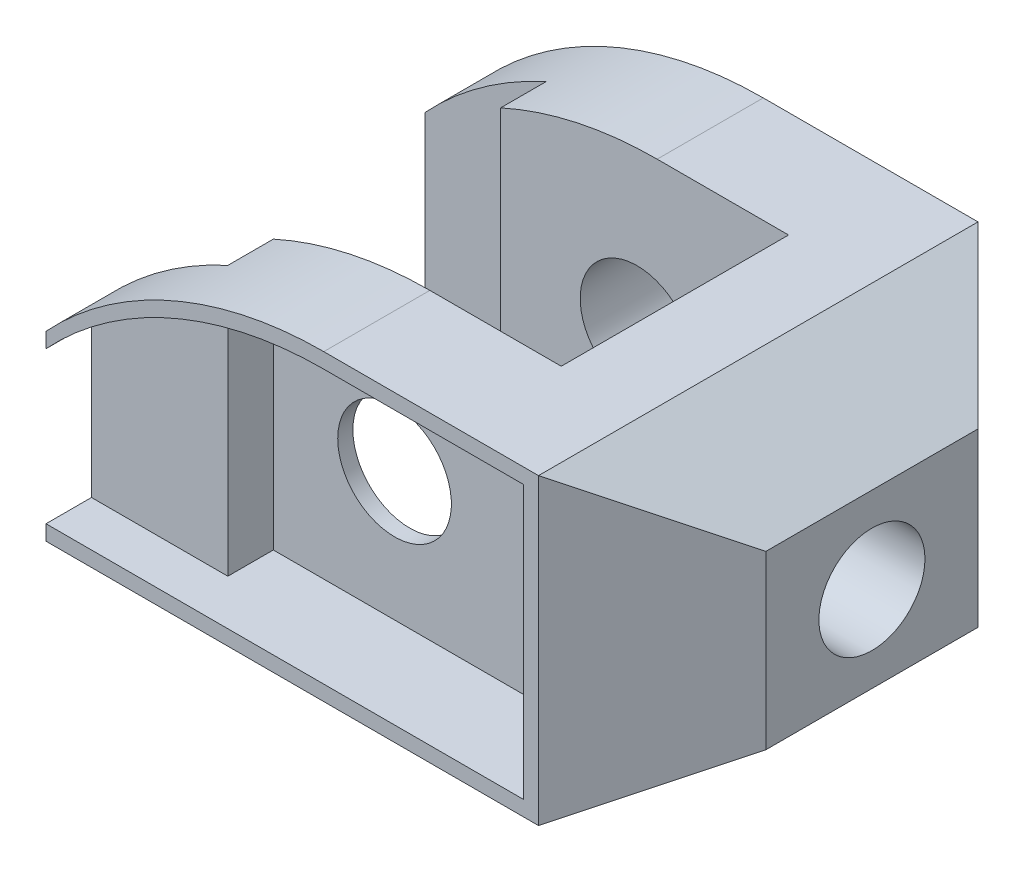
ISO-10303-21;
HEADER;
FILE_DESCRIPTION(('STEP AP214'),'2;1');
FILE_NAME('part.step','',(''),(''),'','','');
FILE_SCHEMA(('AUTOMOTIVE_DESIGN { 1 0 10303 214 1 1 1 1 }'));
ENDSEC;
DATA;
#1=APPLICATION_CONTEXT('core data for automotive mechanical design processes');
#2=APPLICATION_PROTOCOL_DEFINITION('international standard','automotive_design',2000,#1);
#3=PRODUCT_CONTEXT('',#1,'mechanical');
#4=PRODUCT('Part','Part','',(#3));
#5=PRODUCT_RELATED_PRODUCT_CATEGORY('part','',(#4));
#6=PRODUCT_DEFINITION_FORMATION('','',#4);
#7=PRODUCT_DEFINITION_CONTEXT('part definition',#1,'design');
#8=PRODUCT_DEFINITION('design','',#6,#7);
#9=PRODUCT_DEFINITION_SHAPE('','',#8);
#10=(LENGTH_UNIT() NAMED_UNIT(*) SI_UNIT(.MILLI.,.METRE.));
#11=(NAMED_UNIT(*) PLANE_ANGLE_UNIT() SI_UNIT($,.RADIAN.));
#12=(NAMED_UNIT(*) SI_UNIT($,.STERADIAN.) SOLID_ANGLE_UNIT());
#13=UNCERTAINTY_MEASURE_WITH_UNIT(LENGTH_MEASURE(1.E-05),#10,'distance_accuracy_value','');
#14=(GEOMETRIC_REPRESENTATION_CONTEXT(3) GLOBAL_UNCERTAINTY_ASSIGNED_CONTEXT((#13)) GLOBAL_UNIT_ASSIGNED_CONTEXT((#10,
#11,#12)) REPRESENTATION_CONTEXT('',''));
#15=CARTESIAN_POINT('',(0.,0.,0.));
#16=DIRECTION('',(0.,0.,1.));
#17=DIRECTION('',(1.,0.,0.));
#18=AXIS2_PLACEMENT_3D('',#15,#16,#17);
#19=CARTESIAN_POINT('',(2.66060555964671,-29.,52.));
#20=DIRECTION('',(0.,0.,-1.));
#21=DIRECTION('',(-1.,0.,0.));
#22=AXIS2_PLACEMENT_3D('',#19,#20,#21);
#23=PLANE('',#22);
#24=DIRECTION('',(0.,1.,0.));
#25=VECTOR('',#24,1.);
#26=CARTESIAN_POINT('',(-16.,-17.,52.));
#27=LINE('',#26,#25);
#28=CARTESIAN_POINT('',(-16.,-17.,52.));
#29=VERTEX_POINT('',#28);
#30=CARTESIAN_POINT('',(-16.,15.3873021434453,52.));
#31=VERTEX_POINT('',#30);
#32=EDGE_CURVE('E221',#29,#31,#27,.T.);
#33=ORIENTED_EDGE('',*,*,#32,.T.);
#34=CARTESIAN_POINT('',(2.66060555964671,-31.,52.));
#35=DIRECTION('',(0.,0.,-1.));
#36=DIRECTION('',(-1.,0.,0.));
#37=AXIS2_PLACEMENT_3D('',#34,#35,#36);
#38=CIRCLE('',#37,50.);
#39=CARTESIAN_POINT('',(-34.,3.00000000000002,52.));
#40=VERTEX_POINT('',#39);
#41=EDGE_CURVE('E233',#40,#31,#38,.T.);
#42=ORIENTED_EDGE('',*,*,#41,.F.);
#43=DIRECTION('',(0.,-1.,0.));
#44=VECTOR('',#43,1.);
#45=CARTESIAN_POINT('',(-34.,-19.,52.));
#46=LINE('',#45,#44);
#47=CARTESIAN_POINT('',(-34.,-17.,52.));
#48=VERTEX_POINT('',#47);
#49=EDGE_CURVE('E228',#40,#48,#46,.T.);
#50=ORIENTED_EDGE('',*,*,#49,.T.);
#51=DIRECTION('',(-1.,0.,0.));
#52=VECTOR('',#51,1.);
#53=CARTESIAN_POINT('',(29.,-17.,52.));
#54=LINE('',#53,#52);
#55=EDGE_CURVE('E236',#29,#48,#54,.T.);
#56=ORIENTED_EDGE('',*,*,#55,.F.);
#57=EDGE_LOOP('',(#33,#42,#50,#56));
#58=FACE_BOUND('',#57,.T.);
#59=ADVANCED_FACE('F45',(#58),#23,.F.);
#60=CARTESIAN_POINT('',(-34.,-19.,58.));
#61=DIRECTION('',(1.,0.,0.));
#62=DIRECTION('',(0.,0.,-1.));
#63=AXIS2_PLACEMENT_3D('',#60,#61,#62);
#64=PLANE('',#63);
#65=DIRECTION('',(0.,0.,-1.));
#66=VECTOR('',#65,1.);
#67=CARTESIAN_POINT('',(-34.,3.00000000000002,191.252579712364));
#68=LINE('',#67,#66);
#69=CARTESIAN_POINT('',(-34.,3.00000000000002,58.));
#70=VERTEX_POINT('',#69);
#71=EDGE_CURVE('E61',#70,#40,#68,.T.);
#72=ORIENTED_EDGE('',*,*,#71,.F.);
#73=DIRECTION('',(0.,-1.,0.));
#74=VECTOR('',#73,1.);
#75=CARTESIAN_POINT('',(-34.,-19.,58.));
#76=LINE('',#75,#74);
#77=CARTESIAN_POINT('',(-34.,5.,58.));
#78=VERTEX_POINT('',#77);
#79=EDGE_CURVE('E346',#78,#70,#76,.T.);
#80=ORIENTED_EDGE('',*,*,#79,.F.);
#81=DIRECTION('',(0.,0.,-1.));
#82=VECTOR('',#81,1.);
#83=CARTESIAN_POINT('',(-34.,5.,58.));
#84=LINE('',#83,#82);
#85=CARTESIAN_POINT('',(-34.,5.,50.));
#86=VERTEX_POINT('',#85);
#87=EDGE_CURVE('E369',#78,#86,#84,.T.);
#88=ORIENTED_EDGE('',*,*,#87,.T.);
#89=DIRECTION('',(0.,1.,0.));
#90=VECTOR('',#89,1.);
#91=CARTESIAN_POINT('',(-34.,-19.,50.));
#92=LINE('',#91,#90);
#93=CARTESIAN_POINT('',(-34.,-19.,50.));
#94=VERTEX_POINT('',#93);
#95=EDGE_CURVE('E289',#94,#86,#92,.T.);
#96=ORIENTED_EDGE('',*,*,#95,.F.);
#97=DIRECTION('',(0.,0.,-1.));
#98=VECTOR('',#97,1.);
#99=CARTESIAN_POINT('',(-34.,-19.,58.));
#100=LINE('',#99,#98);
#101=CARTESIAN_POINT('',(-34.,-19.,58.));
#102=VERTEX_POINT('',#101);
#103=EDGE_CURVE('E389',#102,#94,#100,.T.);
#104=ORIENTED_EDGE('',*,*,#103,.F.);
#105=CARTESIAN_POINT('',(-34.,-17.,58.));
#106=VERTEX_POINT('',#105);
#107=EDGE_CURVE('E350',#106,#102,#76,.T.);
#108=ORIENTED_EDGE('',*,*,#107,.F.);
#109=DIRECTION('',(0.,0.,-1.));
#110=VECTOR('',#109,1.);
#111=CARTESIAN_POINT('',(-34.,-17.,191.252579712364));
#112=LINE('',#111,#110);
#113=EDGE_CURVE('E235',#106,#48,#112,.T.);
#114=ORIENTED_EDGE('',*,*,#113,.T.);
#115=ORIENTED_EDGE('',*,*,#49,.F.);
#116=EDGE_LOOP('',(#72,#80,#88,#96,#104,#108,#114,#115));
#117=FACE_BOUND('',#116,.T.);
#118=ADVANCED_FACE('F47',(#117),#64,.F.);
#119=CARTESIAN_POINT('',(2.66060555964671,-29.,58.));
#120=DIRECTION('',(0.,0.,-1.));
#121=DIRECTION('',(-1.,0.,0.));
#122=AXIS2_PLACEMENT_3D('',#119,#120,#121);
#123=PLANE('',#122);
#124=ORIENTED_EDGE('',*,*,#79,.T.);
#125=CARTESIAN_POINT('',(2.66060555964671,-31.,58.));
#126=DIRECTION('',(0.,0.,-1.));
#127=DIRECTION('',(-1.,0.,0.));
#128=AXIS2_PLACEMENT_3D('',#125,#126,#127);
#129=CIRCLE('',#128,50.);
#130=CARTESIAN_POINT('',(2.66060555964671,19.,58.));
#131=VERTEX_POINT('',#130);
#132=EDGE_CURVE('E239',#70,#131,#129,.T.);
#133=ORIENTED_EDGE('',*,*,#132,.T.);
#134=DIRECTION('',(1.,0.,0.));
#135=VECTOR('',#134,1.);
#136=CARTESIAN_POINT('',(29.,19.,58.));
#137=LINE('',#136,#135);
#138=CARTESIAN_POINT('',(29.,19.,58.));
#139=VERTEX_POINT('',#138);
#140=EDGE_CURVE('E242',#131,#139,#137,.T.);
#141=ORIENTED_EDGE('',*,*,#140,.T.);
#142=DIRECTION('',(0.,-1.,0.));
#143=VECTOR('',#142,1.);
#144=CARTESIAN_POINT('',(29.,19.,58.));
#145=LINE('',#144,#143);
#146=CARTESIAN_POINT('',(29.,-17.,58.));
#147=VERTEX_POINT('',#146);
#148=EDGE_CURVE('E245',#139,#147,#145,.T.);
#149=ORIENTED_EDGE('',*,*,#148,.T.);
#150=DIRECTION('',(-1.,0.,0.));
#151=VECTOR('',#150,1.);
#152=CARTESIAN_POINT('',(29.,-17.,58.));
#153=LINE('',#152,#151);
#154=EDGE_CURVE('E238',#147,#106,#153,.T.);
#155=ORIENTED_EDGE('',*,*,#154,.T.);
#156=ORIENTED_EDGE('',*,*,#107,.T.);
#157=DIRECTION('',(1.,0.,0.));
#158=VECTOR('',#157,1.);
#159=CARTESIAN_POINT('',(-34.,-19.,58.));
#160=LINE('',#159,#158);
#161=CARTESIAN_POINT('',(31.,-19.,58.));
#162=VERTEX_POINT('',#161);
#163=EDGE_CURVE('E349',#102,#162,#160,.T.);
#164=ORIENTED_EDGE('',*,*,#163,.T.);
#165=DIRECTION('',(0.,-1.,0.));
#166=VECTOR('',#165,1.);
#167=CARTESIAN_POINT('',(31.,24.,58.));
#168=LINE('',#167,#166);
#169=CARTESIAN_POINT('',(31.,21.,58.));
#170=VERTEX_POINT('',#169);
#171=EDGE_CURVE('E258',#170,#162,#168,.T.);
#172=ORIENTED_EDGE('',*,*,#171,.F.);
#173=DIRECTION('',(-1.,0.,0.));
#174=VECTOR('',#173,1.);
#175=CARTESIAN_POINT('',(31.,21.,58.));
#176=LINE('',#175,#174);
#177=CARTESIAN_POINT('',(2.66060555964671,21.,58.));
#178=VERTEX_POINT('',#177);
#179=EDGE_CURVE('E353',#170,#178,#176,.T.);
#180=ORIENTED_EDGE('',*,*,#179,.T.);
#181=CARTESIAN_POINT('',(2.66060555964671,-29.,58.));
#182=DIRECTION('',(0.,0.,1.));
#183=DIRECTION('',(-1.,0.,0.));
#184=AXIS2_PLACEMENT_3D('',#181,#182,#183);
#185=CIRCLE('',#184,50.);
#186=EDGE_CURVE('E355',#178,#78,#185,.T.);
#187=ORIENTED_EDGE('',*,*,#186,.T.);
#188=EDGE_LOOP('',(#124,#133,#141,#149,#155,#156,#164,#172,#180,#187));
#189=FACE_BOUND('',#188,.T.);
#190=ADVANCED_FACE('F409',(#189),#123,.F.);
#191=CARTESIAN_POINT('',(2.66060555964671,-29.,0.));
#192=DIRECTION('',(0.,0.,-1.));
#193=DIRECTION('',(-1.,0.,0.));
#194=AXIS2_PLACEMENT_3D('',#191,#192,#193);
#195=PLANE('',#194);
#196=CARTESIAN_POINT('',(0.,0.,0.));
#197=DIRECTION('',(0.,0.,1.));
#198=DIRECTION('',(1.,0.,0.));
#199=AXIS2_PLACEMENT_3D('',#196,#197,#198);
#200=CIRCLE('',#199,7.5);
#201=CARTESIAN_POINT('',(7.5,0.,0.));
#202=VERTEX_POINT('',#201);
#203=EDGE_CURVE('E342',#202,#202,#200,.T.);
#204=ORIENTED_EDGE('',*,*,#203,.T.);
#205=EDGE_LOOP('',(#204));
#206=FACE_BOUND('',#205,.T.);
#207=DIRECTION('',(-1.,0.,0.));
#208=VECTOR('',#207,1.);
#209=CARTESIAN_POINT('',(31.,21.,0.));
#210=LINE('',#209,#208);
#211=CARTESIAN_POINT('',(31.,21.,0.));
#212=VERTEX_POINT('',#211);
#213=CARTESIAN_POINT('',(2.66060555964671,21.,0.));
#214=VERTEX_POINT('',#213);
#215=EDGE_CURVE('E363',#212,#214,#210,.T.);
#216=ORIENTED_EDGE('',*,*,#215,.F.);
#217=DIRECTION('',(0.,-1.,0.));
#218=VECTOR('',#217,1.);
#219=CARTESIAN_POINT('',(31.,24.,0.));
#220=LINE('',#219,#218);
#221=CARTESIAN_POINT('',(31.,-19.,0.));
#222=VERTEX_POINT('',#221);
#223=EDGE_CURVE('E261',#212,#222,#220,.T.);
#224=ORIENTED_EDGE('',*,*,#223,.T.);
#225=DIRECTION('',(1.,0.,0.));
#226=VECTOR('',#225,1.);
#227=CARTESIAN_POINT('',(-34.,-19.,0.));
#228=LINE('',#227,#226);
#229=CARTESIAN_POINT('',(-34.,-19.,0.));
#230=VERTEX_POINT('',#229);
#231=EDGE_CURVE('E360',#230,#222,#228,.T.);
#232=ORIENTED_EDGE('',*,*,#231,.F.);
#233=DIRECTION('',(0.,-1.,0.));
#234=VECTOR('',#233,1.);
#235=CARTESIAN_POINT('',(-34.,-19.,0.));
#236=LINE('',#235,#234);
#237=CARTESIAN_POINT('',(-34.,5.,0.));
#238=VERTEX_POINT('',#237);
#239=EDGE_CURVE('E345',#238,#230,#236,.T.);
#240=ORIENTED_EDGE('',*,*,#239,.F.);
#241=CARTESIAN_POINT('',(2.66060555964671,-29.,0.));
#242=DIRECTION('',(0.,0.,1.));
#243=DIRECTION('',(-1.,0.,0.));
#244=AXIS2_PLACEMENT_3D('',#241,#242,#243);
#245=CIRCLE('',#244,50.);
#246=EDGE_CURVE('E366',#214,#238,#245,.T.);
#247=ORIENTED_EDGE('',*,*,#246,.F.);
#248=EDGE_LOOP('',(#216,#224,#232,#240,#247));
#249=FACE_BOUND('',#248,.T.);
#250=ADVANCED_FACE('F505',(#206,#249),#195,.T.);
#251=CARTESIAN_POINT('',(31.,-19.,58.));
#252=DIRECTION('',(-0.500000000000001,0.866025403784438,0.));
#253=DIRECTION('',(-0.866025403784438,-0.500000000000001,0.));
#254=AXIS2_PLACEMENT_3D('',#251,#252,#253);
#255=PLANE('',#254);
#256=DIRECTION('',(-0.65465367070798,-0.37796447300923,-0.654653670707973));
#257=VECTOR('',#256,1.);
#258=CARTESIAN_POINT('',(55.8571428571428,-4.64872188014358,24.8571428571425));
#259=LINE('',#258,#257);
#260=CARTESIAN_POINT('',(46.,-10.3397459621556,14.9999999999998));
#261=VERTEX_POINT('',#260);
#262=EDGE_CURVE('E270',#261,#222,#259,.T.);
#263=ORIENTED_EDGE('',*,*,#262,.F.);
#264=DIRECTION('',(0.,0.,-1.));
#265=VECTOR('',#264,1.);
#266=CARTESIAN_POINT('',(46.,-10.3397459621556,58.));
#267=LINE('',#266,#265);
#268=CARTESIAN_POINT('',(46.,-10.3397459621556,43.0000000000002));
#269=VERTEX_POINT('',#268);
#270=EDGE_CURVE('E382',#269,#261,#267,.T.);
#271=ORIENTED_EDGE('',*,*,#270,.F.);
#272=DIRECTION('',(0.65465367070798,0.37796447300923,-0.654653670707973));
#273=VECTOR('',#272,1.);
#274=CARTESIAN_POINT('',(31.,-19.,58.));
#275=LINE('',#274,#273);
#276=EDGE_CURVE('E266',#162,#269,#275,.T.);
#277=ORIENTED_EDGE('',*,*,#276,.F.);
#278=DIRECTION('',(0.,0.,-1.));
#279=VECTOR('',#278,1.);
#280=CARTESIAN_POINT('',(31.,-19.,58.));
#281=LINE('',#280,#279);
#282=EDGE_CURVE('E385',#162,#222,#281,.T.);
#283=ORIENTED_EDGE('',*,*,#282,.T.);
#284=EDGE_LOOP('',(#263,#271,#277,#283));
#285=FACE_BOUND('',#284,.T.);
#286=ADVANCED_FACE('F508',(#285),#255,.F.);
#287=CARTESIAN_POINT('',(46.,12.3397459621557,58.));
#288=DIRECTION('',(-1.,0.,0.));
#289=DIRECTION('',(0.,0.,1.));
#290=AXIS2_PLACEMENT_3D('',#287,#288,#289);
#291=PLANE('',#290);
#292=CARTESIAN_POINT('',(46.,1.00000000000008,29.));
#293=DIRECTION('',(1.,0.,0.));
#294=DIRECTION('',(0.,0.,-1.));
#295=AXIS2_PLACEMENT_3D('',#292,#293,#294);
#296=CIRCLE('',#295,7.);
#297=CARTESIAN_POINT('',(46.,1.00000000000008,22.));
#298=VERTEX_POINT('',#297);
#299=EDGE_CURVE('E339',#298,#298,#296,.T.);
#300=ORIENTED_EDGE('',*,*,#299,.F.);
#301=EDGE_LOOP('',(#300));
#302=FACE_BOUND('',#301,.T.);
#303=DIRECTION('',(0.,-1.,0.));
#304=VECTOR('',#303,1.);
#305=CARTESIAN_POINT('',(46.,24.,14.9999999999998));
#306=LINE('',#305,#304);
#307=CARTESIAN_POINT('',(46.,12.3397459621557,14.9999999999998));
#308=VERTEX_POINT('',#307);
#309=EDGE_CURVE('E264',#308,#261,#306,.T.);
#310=ORIENTED_EDGE('',*,*,#309,.F.);
#311=DIRECTION('',(0.,0.,-1.));
#312=VECTOR('',#311,1.);
#313=CARTESIAN_POINT('',(46.,12.3397459621557,58.));
#314=LINE('',#313,#312);
#315=CARTESIAN_POINT('',(46.,12.3397459621557,43.0000000000002));
#316=VERTEX_POINT('',#315);
#317=EDGE_CURVE('E379',#316,#308,#314,.T.);
#318=ORIENTED_EDGE('',*,*,#317,.F.);
#319=DIRECTION('',(0.,-1.,0.));
#320=VECTOR('',#319,1.);
#321=CARTESIAN_POINT('',(46.,24.,43.0000000000002));
#322=LINE('',#321,#320);
#323=EDGE_CURVE('E69',#316,#269,#322,.T.);
#324=ORIENTED_EDGE('',*,*,#323,.T.);
#325=ORIENTED_EDGE('',*,*,#270,.T.);
#326=EDGE_LOOP('',(#310,#318,#324,#325));
#327=FACE_BOUND('',#326,.T.);
#328=ADVANCED_FACE('F519',(#302,#327),#291,.F.);
#329=CARTESIAN_POINT('',(31.,21.,58.));
#330=DIRECTION('',(-0.499999999999994,-0.866025403784442,0.));
#331=DIRECTION('',(0.866025403784442,-0.499999999999994,0.));
#332=AXIS2_PLACEMENT_3D('',#329,#330,#331);
#333=PLANE('',#332);
#334=DIRECTION('',(0.654653670707982,-0.377964473009224,0.654653670707974));
#335=VECTOR('',#334,1.);
#336=CARTESIAN_POINT('',(55.8571428571429,6.64872188014378,24.8571428571427));
#337=LINE('',#336,#335);
#338=EDGE_CURVE('E11',#212,#308,#337,.T.);
#339=ORIENTED_EDGE('',*,*,#338,.F.);
#340=DIRECTION('',(0.,0.,-1.));
#341=VECTOR('',#340,1.);
#342=CARTESIAN_POINT('',(31.,21.,58.));
#343=LINE('',#342,#341);
#344=EDGE_CURVE('E376',#170,#212,#343,.T.);
#345=ORIENTED_EDGE('',*,*,#344,.F.);
#346=DIRECTION('',(-0.654653670707982,0.377964473009224,0.654653670707974));
#347=VECTOR('',#346,1.);
#348=CARTESIAN_POINT('',(31.,21.,58.));
#349=LINE('',#348,#347);
#350=EDGE_CURVE('E54',#316,#170,#349,.T.);
#351=ORIENTED_EDGE('',*,*,#350,.F.);
#352=ORIENTED_EDGE('',*,*,#317,.T.);
#353=EDGE_LOOP('',(#339,#345,#351,#352));
#354=FACE_BOUND('',#353,.T.);
#355=ADVANCED_FACE('F415',(#354),#333,.F.);
#356=CARTESIAN_POINT('',(-34.,-19.,8.));
#357=VERTEX_POINT('',#356);
#358=EDGE_CURVE('E388',#357,#230,#100,.T.);
#359=ORIENTED_EDGE('',*,*,#358,.F.);
#360=DIRECTION('',(0.,1.,0.));
#361=VECTOR('',#360,1.);
#362=CARTESIAN_POINT('',(-34.,-19.,8.));
#363=LINE('',#362,#361);
#364=CARTESIAN_POINT('',(-34.,5.00000000000001,8.));
#365=VERTEX_POINT('',#364);
#366=EDGE_CURVE('E281',#357,#365,#363,.T.);
#367=ORIENTED_EDGE('',*,*,#366,.T.);
#368=EDGE_CURVE('E357',#365,#238,#84,.T.);
#369=ORIENTED_EDGE('',*,*,#368,.T.);
#370=ORIENTED_EDGE('',*,*,#239,.T.);
#371=EDGE_LOOP('',(#359,#367,#369,#370));
#372=FACE_BOUND('',#371,.T.);
#373=ADVANCED_FACE('F458',(#372),#64,.F.);
#374=CARTESIAN_POINT('',(-34.,-19.,58.));
#375=DIRECTION('',(0.,1.,0.));
#376=DIRECTION('',(-1.,0.,0.));
#377=AXIS2_PLACEMENT_3D('',#374,#375,#376);
#378=PLANE('',#377);
#379=DIRECTION('',(0.,0.,-1.));
#380=VECTOR('',#379,1.);
#381=CARTESIAN_POINT('',(-18.,-19.,8.));
#382=LINE('',#381,#380);
#383=CARTESIAN_POINT('',(-18.,-19.,14.));
#384=VERTEX_POINT('',#383);
#385=CARTESIAN_POINT('',(-18.,-19.,8.));
#386=VERTEX_POINT('',#385);
#387=EDGE_CURVE('E273',#384,#386,#382,.T.);
#388=ORIENTED_EDGE('',*,*,#387,.T.);
#389=DIRECTION('',(-1.,0.,0.));
#390=VECTOR('',#389,1.);
#391=CARTESIAN_POINT('',(-34.,-19.,8.));
#392=LINE('',#391,#390);
#393=EDGE_CURVE('E276',#386,#357,#392,.T.);
#394=ORIENTED_EDGE('',*,*,#393,.T.);
#395=ORIENTED_EDGE('',*,*,#358,.T.);
#396=ORIENTED_EDGE('',*,*,#231,.T.);
#397=ORIENTED_EDGE('',*,*,#282,.F.);
#398=ORIENTED_EDGE('',*,*,#163,.F.);
#399=ORIENTED_EDGE('',*,*,#103,.T.);
#400=DIRECTION('',(1.,0.,0.));
#401=VECTOR('',#400,1.);
#402=CARTESIAN_POINT('',(-34.,-19.,50.));
#403=LINE('',#402,#401);
#404=CARTESIAN_POINT('',(-18.,-19.,50.));
#405=VERTEX_POINT('',#404);
#406=EDGE_CURVE('E277',#94,#405,#403,.T.);
#407=ORIENTED_EDGE('',*,*,#406,.T.);
#408=DIRECTION('',(0.,0.,-1.));
#409=VECTOR('',#408,1.);
#410=CARTESIAN_POINT('',(-18.,-19.,50.));
#411=LINE('',#410,#409);
#412=CARTESIAN_POINT('',(-18.,-19.,44.));
#413=VERTEX_POINT('',#412);
#414=EDGE_CURVE('E291',#405,#413,#411,.T.);
#415=ORIENTED_EDGE('',*,*,#414,.T.);
#416=DIRECTION('',(-1.,0.,0.));
#417=VECTOR('',#416,1.);
#418=CARTESIAN_POINT('',(-34.,-19.,44.));
#419=LINE('',#418,#417);
#420=CARTESIAN_POINT('',(20.,-19.,44.));
#421=VERTEX_POINT('',#420);
#422=EDGE_CURVE('E327',#421,#413,#419,.T.);
#423=ORIENTED_EDGE('',*,*,#422,.F.);
#424=DIRECTION('',(0.,0.,1.));
#425=VECTOR('',#424,1.);
#426=CARTESIAN_POINT('',(20.,-19.,58.));
#427=LINE('',#426,#425);
#428=CARTESIAN_POINT('',(20.,-19.,14.));
#429=VERTEX_POINT('',#428);
#430=EDGE_CURVE('E318',#429,#421,#427,.T.);
#431=ORIENTED_EDGE('',*,*,#430,.F.);
#432=DIRECTION('',(1.,0.,0.));
#433=VECTOR('',#432,1.);
#434=CARTESIAN_POINT('',(-34.,-19.,14.));
#435=LINE('',#434,#433);
#436=EDGE_CURVE('E337',#384,#429,#435,.T.);
#437=ORIENTED_EDGE('',*,*,#436,.F.);
#438=EDGE_LOOP('',(#388,#394,#395,#396,#397,#398,#399,#407,#415,#423,#431,#437));
#439=FACE_BOUND('',#438,.T.);
#440=ADVANCED_FACE('F516',(#439),#378,.F.);
#441=CARTESIAN_POINT('',(31.,21.,58.));
#442=DIRECTION('',(0.,-1.,0.));
#443=DIRECTION('',(1.,0.,0.));
#444=AXIS2_PLACEMENT_3D('',#441,#442,#443);
#445=PLANE('',#444);
#446=DIRECTION('',(-1.,0.,0.));
#447=VECTOR('',#446,1.);
#448=CARTESIAN_POINT('',(31.,21.,14.));
#449=LINE('',#448,#447);
#450=CARTESIAN_POINT('',(20.,21.,14.));
#451=VERTEX_POINT('',#450);
#452=CARTESIAN_POINT('',(2.66060555964671,21.,14.));
#453=VERTEX_POINT('',#452);
#454=EDGE_CURVE('E334',#451,#453,#449,.T.);
#455=ORIENTED_EDGE('',*,*,#454,.F.);
#456=DIRECTION('',(0.,0.,-1.));
#457=VECTOR('',#456,1.);
#458=CARTESIAN_POINT('',(20.,21.,58.));
#459=LINE('',#458,#457);
#460=CARTESIAN_POINT('',(20.,21.,44.));
#461=VERTEX_POINT('',#460);
#462=EDGE_CURVE('E315',#461,#451,#459,.T.);
#463=ORIENTED_EDGE('',*,*,#462,.F.);
#464=DIRECTION('',(1.,0.,0.));
#465=VECTOR('',#464,1.);
#466=CARTESIAN_POINT('',(31.,21.,44.));
#467=LINE('',#466,#465);
#468=CARTESIAN_POINT('',(2.66060555964671,21.,44.));
#469=VERTEX_POINT('',#468);
#470=EDGE_CURVE('E324',#469,#461,#467,.T.);
#471=ORIENTED_EDGE('',*,*,#470,.F.);
#472=DIRECTION('',(0.,0.,-1.));
#473=VECTOR('',#472,1.);
#474=CARTESIAN_POINT('',(2.66060555964671,21.,58.));
#475=LINE('',#474,#473);
#476=EDGE_CURVE('E373',#178,#469,#475,.T.);
#477=ORIENTED_EDGE('',*,*,#476,.F.);
#478=ORIENTED_EDGE('',*,*,#179,.F.);
#479=ORIENTED_EDGE('',*,*,#344,.T.);
#480=ORIENTED_EDGE('',*,*,#215,.T.);
#481=EDGE_CURVE('E372',#453,#214,#475,.T.);
#482=ORIENTED_EDGE('',*,*,#481,.F.);
#483=EDGE_LOOP('',(#455,#463,#471,#477,#478,#479,#480,#482));
#484=FACE_BOUND('',#483,.T.);
#485=ADVANCED_FACE('F418',(#484),#445,.F.);
#486=CARTESIAN_POINT('',(2.66060555964671,-29.,58.));
#487=DIRECTION('',(0.,0.,-1.));
#488=DIRECTION('',(-1.,0.,0.));
#489=AXIS2_PLACEMENT_3D('',#486,#487,#488);
#490=CYLINDRICAL_SURFACE('',#489,50.);
#491=ORIENTED_EDGE('',*,*,#368,.F.);
#492=CARTESIAN_POINT('',(2.66060555964671,-29.,8.));
#493=DIRECTION('',(0.,0.,-1.));
#494=DIRECTION('',(-1.,0.,0.));
#495=AXIS2_PLACEMENT_3D('',#492,#493,#494);
#496=CIRCLE('',#495,50.);
#497=CARTESIAN_POINT('',(-18.,16.5317403347236,8.));
#498=VERTEX_POINT('',#497);
#499=EDGE_CURVE('E395',#365,#498,#496,.T.);
#500=ORIENTED_EDGE('',*,*,#499,.T.);
#501=DIRECTION('',(0.,0.,-1.));
#502=VECTOR('',#501,1.);
#503=CARTESIAN_POINT('',(-18.,16.5317403347236,58.));
#504=LINE('',#503,#502);
#505=CARTESIAN_POINT('',(-18.,16.5317403347236,14.));
#506=VERTEX_POINT('',#505);
#507=EDGE_CURVE('E303',#498,#506,#504,.F.);
#508=ORIENTED_EDGE('',*,*,#507,.T.);
#509=CARTESIAN_POINT('',(2.66060555964671,-29.,14.));
#510=DIRECTION('',(0.,0.,1.));
#511=DIRECTION('',(1.,0.,0.));
#512=AXIS2_PLACEMENT_3D('',#509,#510,#511);
#513=CIRCLE('',#512,50.);
#514=EDGE_CURVE('E331',#453,#506,#513,.T.);
#515=ORIENTED_EDGE('',*,*,#514,.F.);
#516=ORIENTED_EDGE('',*,*,#481,.T.);
#517=ORIENTED_EDGE('',*,*,#246,.T.);
#518=EDGE_LOOP('',(#491,#500,#508,#515,#516,#517));
#519=FACE_BOUND('',#518,.T.);
#520=ADVANCED_FACE('F510',(#519),#490,.T.);
#521=CARTESIAN_POINT('',(2.66060555964671,-29.,44.));
#522=DIRECTION('',(0.,0.,-1.));
#523=DIRECTION('',(-1.,0.,0.));
#524=AXIS2_PLACEMENT_3D('',#521,#522,#523);
#525=CIRCLE('',#524,50.);
#526=CARTESIAN_POINT('',(-18.,16.5317403347236,44.));
#527=VERTEX_POINT('',#526);
#528=EDGE_CURVE('E322',#527,#469,#525,.T.);
#529=ORIENTED_EDGE('',*,*,#528,.F.);
#530=DIRECTION('',(0.,0.,-1.));
#531=VECTOR('',#530,1.);
#532=CARTESIAN_POINT('',(-18.,16.5317403347236,58.));
#533=LINE('',#532,#531);
#534=CARTESIAN_POINT('',(-18.,16.5317403347236,50.));
#535=VERTEX_POINT('',#534);
#536=EDGE_CURVE('E284',#527,#535,#533,.F.);
#537=ORIENTED_EDGE('',*,*,#536,.T.);
#538=CARTESIAN_POINT('',(2.66060555964671,-29.,50.));
#539=DIRECTION('',(0.,0.,1.));
#540=DIRECTION('',(1.,0.,0.));
#541=AXIS2_PLACEMENT_3D('',#538,#539,#540);
#542=CIRCLE('',#541,50.);
#543=EDGE_CURVE('E306',#535,#86,#542,.T.);
#544=ORIENTED_EDGE('',*,*,#543,.T.);
#545=ORIENTED_EDGE('',*,*,#87,.F.);
#546=ORIENTED_EDGE('',*,*,#186,.F.);
#547=ORIENTED_EDGE('',*,*,#476,.T.);
#548=EDGE_LOOP('',(#529,#537,#544,#545,#546,#547));
#549=FACE_BOUND('',#548,.T.);
#550=ADVANCED_FACE('F424',(#549),#490,.T.);
#551=CARTESIAN_POINT('',(0.,0.,58.));
#552=DIRECTION('',(0.,0.,-1.));
#553=DIRECTION('',(-1.,0.,0.));
#554=AXIS2_PLACEMENT_3D('',#551,#552,#553);
#555=CYLINDRICAL_SURFACE('',#554,7.5);
#556=ORIENTED_EDGE('',*,*,#203,.F.);
#557=EDGE_LOOP('',(#556));
#558=FACE_BOUND('',#557,.T.);
#559=CARTESIAN_POINT('',(0.,0.,14.));
#560=DIRECTION('',(0.,0.,1.));
#561=DIRECTION('',(1.,0.,0.));
#562=AXIS2_PLACEMENT_3D('',#559,#560,#561);
#563=CIRCLE('',#562,7.5);
#564=CARTESIAN_POINT('',(7.5,0.,14.));
#565=VERTEX_POINT('',#564);
#566=EDGE_CURVE('E330',#565,#565,#563,.T.);
#567=ORIENTED_EDGE('',*,*,#566,.T.);
#568=EDGE_LOOP('',(#567));
#569=FACE_BOUND('',#568,.T.);
#570=ADVANCED_FACE('F500',(#558,#569),#555,.F.);
#571=CARTESIAN_POINT('',(0.,0.,46.));
#572=DIRECTION('',(0.,0.,-1.));
#573=DIRECTION('',(-1.,0.,0.));
#574=AXIS2_PLACEMENT_3D('',#571,#572,#573);
#575=CIRCLE('',#574,7.5);
#576=CARTESIAN_POINT('',(-7.5,0.,46.));
#577=VERTEX_POINT('',#576);
#578=EDGE_CURVE('E49',#577,#577,#575,.T.);
#579=ORIENTED_EDGE('',*,*,#578,.F.);
#580=EDGE_LOOP('',(#579));
#581=FACE_BOUND('',#580,.T.);
#582=CARTESIAN_POINT('',(0.,0.,44.));
#583=DIRECTION('',(0.,0.,-1.));
#584=DIRECTION('',(-1.,0.,0.));
#585=AXIS2_PLACEMENT_3D('',#582,#583,#584);
#586=CIRCLE('',#585,7.5);
#587=CARTESIAN_POINT('',(-7.5,0.,44.));
#588=VERTEX_POINT('',#587);
#589=EDGE_CURVE('E321',#588,#588,#586,.T.);
#590=ORIENTED_EDGE('',*,*,#589,.T.);
#591=EDGE_LOOP('',(#590));
#592=FACE_BOUND('',#591,.T.);
#593=ADVANCED_FACE('F498',(#581,#592),#555,.F.);
#594=CARTESIAN_POINT('',(-34.,1.00000000000008,29.));
#595=DIRECTION('',(1.,0.,0.));
#596=DIRECTION('',(0.,0.,-1.));
#597=AXIS2_PLACEMENT_3D('',#594,#595,#596);
#598=CYLINDRICAL_SURFACE('',#597,7.);
#599=ORIENTED_EDGE('',*,*,#299,.T.);
#600=EDGE_LOOP('',(#599));
#601=FACE_BOUND('',#600,.T.);
#602=CARTESIAN_POINT('',(20.,1.00000000000008,29.));
#603=DIRECTION('',(-1.,0.,0.));
#604=DIRECTION('',(0.,0.,1.));
#605=AXIS2_PLACEMENT_3D('',#602,#603,#604);
#606=CIRCLE('',#605,7.);
#607=CARTESIAN_POINT('',(20.,1.00000000000008,36.));
#608=VERTEX_POINT('',#607);
#609=EDGE_CURVE('E392',#608,#608,#606,.F.);
#610=ORIENTED_EDGE('',*,*,#609,.F.);
#611=EDGE_LOOP('',(#610));
#612=FACE_BOUND('',#611,.T.);
#613=ADVANCED_FACE('F494',(#601,#612),#598,.F.);
#614=CARTESIAN_POINT('',(-34.,157.69619623991,14.));
#615=DIRECTION('',(0.,0.,1.));
#616=DIRECTION('',(1.,0.,0.));
#617=AXIS2_PLACEMENT_3D('',#614,#615,#616);
#618=PLANE('',#617);
#619=DIRECTION('',(0.,1.,0.));
#620=VECTOR('',#619,1.);
#621=CARTESIAN_POINT('',(-18.,-19.,14.));
#622=LINE('',#621,#620);
#623=EDGE_CURVE('E280',#384,#506,#622,.T.);
#624=ORIENTED_EDGE('',*,*,#623,.F.);
#625=ORIENTED_EDGE('',*,*,#436,.T.);
#626=DIRECTION('',(0.,-1.,0.));
#627=VECTOR('',#626,1.);
#628=CARTESIAN_POINT('',(20.,157.69619623991,14.));
#629=LINE('',#628,#627);
#630=EDGE_CURVE('E312',#451,#429,#629,.T.);
#631=ORIENTED_EDGE('',*,*,#630,.F.);
#632=ORIENTED_EDGE('',*,*,#454,.T.);
#633=ORIENTED_EDGE('',*,*,#514,.T.);
#634=EDGE_LOOP('',(#624,#625,#631,#632,#633));
#635=FACE_BOUND('',#634,.T.);
#636=ORIENTED_EDGE('',*,*,#566,.F.);
#637=EDGE_LOOP('',(#636));
#638=FACE_BOUND('',#637,.T.);
#639=ADVANCED_FACE('F487',(#635,#638),#618,.T.);
#640=CARTESIAN_POINT('',(-34.,157.69619623991,44.));
#641=DIRECTION('',(0.,0.,-1.));
#642=DIRECTION('',(-1.,0.,0.));
#643=AXIS2_PLACEMENT_3D('',#640,#641,#642);
#644=PLANE('',#643);
#645=DIRECTION('',(0.,1.,0.));
#646=VECTOR('',#645,1.);
#647=CARTESIAN_POINT('',(-18.,-19.,44.));
#648=LINE('',#647,#646);
#649=EDGE_CURVE('E272',#413,#527,#648,.T.);
#650=ORIENTED_EDGE('',*,*,#649,.T.);
#651=ORIENTED_EDGE('',*,*,#528,.T.);
#652=ORIENTED_EDGE('',*,*,#470,.T.);
#653=DIRECTION('',(0.,-1.,0.));
#654=VECTOR('',#653,1.);
#655=CARTESIAN_POINT('',(20.,157.69619623991,44.));
#656=LINE('',#655,#654);
#657=EDGE_CURVE('E309',#461,#421,#656,.T.);
#658=ORIENTED_EDGE('',*,*,#657,.T.);
#659=ORIENTED_EDGE('',*,*,#422,.T.);
#660=EDGE_LOOP('',(#650,#651,#652,#658,#659));
#661=FACE_BOUND('',#660,.T.);
#662=ORIENTED_EDGE('',*,*,#589,.F.);
#663=EDGE_LOOP('',(#662));
#664=FACE_BOUND('',#663,.T.);
#665=ADVANCED_FACE('F484',(#661,#664),#644,.T.);
#666=CARTESIAN_POINT('',(20.,157.69619623991,14.));
#667=DIRECTION('',(-1.,0.,0.));
#668=DIRECTION('',(0.,0.,1.));
#669=AXIS2_PLACEMENT_3D('',#666,#667,#668);
#670=PLANE('',#669);
#671=ORIENTED_EDGE('',*,*,#609,.T.);
#672=EDGE_LOOP('',(#671));
#673=FACE_BOUND('',#672,.T.);
#674=ORIENTED_EDGE('',*,*,#630,.T.);
#675=ORIENTED_EDGE('',*,*,#430,.T.);
#676=ORIENTED_EDGE('',*,*,#657,.F.);
#677=ORIENTED_EDGE('',*,*,#462,.T.);
#678=EDGE_LOOP('',(#674,#675,#676,#677));
#679=FACE_BOUND('',#678,.T.);
#680=ADVANCED_FACE('F479',(#673,#679),#670,.T.);
#681=CARTESIAN_POINT('',(-34.,-19.,50.));
#682=DIRECTION('',(0.,0.,1.));
#683=DIRECTION('',(1.,0.,0.));
#684=AXIS2_PLACEMENT_3D('',#681,#682,#683);
#685=PLANE('',#684);
#686=DIRECTION('',(0.,1.,0.));
#687=VECTOR('',#686,1.);
#688=CARTESIAN_POINT('',(-18.,-19.,50.));
#689=LINE('',#688,#687);
#690=EDGE_CURVE('E292',#405,#535,#689,.T.);
#691=ORIENTED_EDGE('',*,*,#690,.F.);
#692=ORIENTED_EDGE('',*,*,#406,.F.);
#693=ORIENTED_EDGE('',*,*,#95,.T.);
#694=ORIENTED_EDGE('',*,*,#543,.F.);
#695=EDGE_LOOP('',(#691,#692,#693,#694));
#696=FACE_BOUND('',#695,.T.);
#697=ADVANCED_FACE('F476',(#696),#685,.F.);
#698=CARTESIAN_POINT('',(-18.,-19.,50.));
#699=DIRECTION('',(1.,0.,0.));
#700=DIRECTION('',(0.,0.,-1.));
#701=AXIS2_PLACEMENT_3D('',#698,#699,#700);
#702=PLANE('',#701);
#703=ORIENTED_EDGE('',*,*,#649,.F.);
#704=ORIENTED_EDGE('',*,*,#414,.F.);
#705=ORIENTED_EDGE('',*,*,#690,.T.);
#706=ORIENTED_EDGE('',*,*,#536,.F.);
#707=EDGE_LOOP('',(#703,#704,#705,#706));
#708=FACE_BOUND('',#707,.T.);
#709=ADVANCED_FACE('F471',(#708),#702,.F.);
#710=CARTESIAN_POINT('',(-34.,-19.,8.));
#711=DIRECTION('',(0.,0.,-1.));
#712=DIRECTION('',(-1.,0.,0.));
#713=AXIS2_PLACEMENT_3D('',#710,#711,#712);
#714=PLANE('',#713);
#715=ORIENTED_EDGE('',*,*,#366,.F.);
#716=ORIENTED_EDGE('',*,*,#393,.F.);
#717=DIRECTION('',(0.,1.,0.));
#718=VECTOR('',#717,1.);
#719=CARTESIAN_POINT('',(-18.,-19.,8.));
#720=LINE('',#719,#718);
#721=EDGE_CURVE('E285',#386,#498,#720,.T.);
#722=ORIENTED_EDGE('',*,*,#721,.T.);
#723=ORIENTED_EDGE('',*,*,#499,.F.);
#724=EDGE_LOOP('',(#715,#716,#722,#723));
#725=FACE_BOUND('',#724,.T.);
#726=ADVANCED_FACE('F468',(#725),#714,.F.);
#727=CARTESIAN_POINT('',(-18.,-19.,8.));
#728=DIRECTION('',(1.,0.,0.));
#729=DIRECTION('',(0.,0.,-1.));
#730=AXIS2_PLACEMENT_3D('',#727,#728,#729);
#731=PLANE('',#730);
#732=ORIENTED_EDGE('',*,*,#721,.F.);
#733=ORIENTED_EDGE('',*,*,#387,.F.);
#734=ORIENTED_EDGE('',*,*,#623,.T.);
#735=ORIENTED_EDGE('',*,*,#507,.F.);
#736=EDGE_LOOP('',(#732,#733,#734,#735));
#737=FACE_BOUND('',#736,.T.);
#738=ADVANCED_FACE('F467',(#737),#731,.F.);
#739=CARTESIAN_POINT('',(46.,24.,43.0000000000002));
#740=DIRECTION('',(0.707106781186544,0.,0.707106781186551));
#741=DIRECTION('',(0.707106781186551,0.,-0.707106781186544));
#742=AXIS2_PLACEMENT_3D('',#739,#740,#741);
#743=PLANE('',#742);
#744=ORIENTED_EDGE('',*,*,#276,.T.);
#745=ORIENTED_EDGE('',*,*,#323,.F.);
#746=ORIENTED_EDGE('',*,*,#350,.T.);
#747=ORIENTED_EDGE('',*,*,#171,.T.);
#748=EDGE_LOOP('',(#744,#745,#746,#747));
#749=FACE_BOUND('',#748,.T.);
#750=ADVANCED_FACE('F403',(#749),#743,.T.);
#751=CARTESIAN_POINT('',(46.,24.,14.9999999999998));
#752=DIRECTION('',(0.707106781186544,0.,-0.707106781186552));
#753=DIRECTION('',(-0.707106781186552,0.,-0.707106781186544));
#754=AXIS2_PLACEMENT_3D('',#751,#752,#753);
#755=PLANE('',#754);
#756=ORIENTED_EDGE('',*,*,#262,.T.);
#757=ORIENTED_EDGE('',*,*,#223,.F.);
#758=ORIENTED_EDGE('',*,*,#338,.T.);
#759=ORIENTED_EDGE('',*,*,#309,.T.);
#760=EDGE_LOOP('',(#756,#757,#758,#759));
#761=FACE_BOUND('',#760,.T.);
#762=ADVANCED_FACE('F461',(#761),#755,.T.);
#763=CARTESIAN_POINT('',(2.66060555964671,-31.,191.252579712364));
#764=DIRECTION('',(0.,0.,-1.));
#765=DIRECTION('',(-1.,0.,0.));
#766=AXIS2_PLACEMENT_3D('',#763,#764,#765);
#767=CYLINDRICAL_SURFACE('',#766,50.);
#768=ORIENTED_EDGE('',*,*,#132,.F.);
#769=ORIENTED_EDGE('',*,*,#71,.T.);
#770=ORIENTED_EDGE('',*,*,#41,.T.);
#771=DIRECTION('',(0.,0.,1.));
#772=VECTOR('',#771,1.);
#773=CARTESIAN_POINT('',(-16.,15.3873021434453,46.));
#774=LINE('',#773,#772);
#775=CARTESIAN_POINT('',(-16.,15.3873021434453,46.));
#776=VERTEX_POINT('',#775);
#777=EDGE_CURVE('E225',#776,#31,#774,.T.);
#778=ORIENTED_EDGE('',*,*,#777,.F.);
#779=CARTESIAN_POINT('',(2.66060555964671,-31.,46.));
#780=DIRECTION('',(0.,0.,-1.));
#781=DIRECTION('',(-1.,0.,0.));
#782=AXIS2_PLACEMENT_3D('',#779,#780,#781);
#783=CIRCLE('',#782,50.);
#784=CARTESIAN_POINT('',(2.66060555964671,19.,46.));
#785=VERTEX_POINT('',#784);
#786=EDGE_CURVE('E209',#776,#785,#783,.T.);
#787=ORIENTED_EDGE('',*,*,#786,.T.);
#788=DIRECTION('',(0.,0.,-1.));
#789=VECTOR('',#788,1.);
#790=CARTESIAN_POINT('',(2.66060555964671,19.,191.252579712364));
#791=LINE('',#790,#789);
#792=EDGE_CURVE('E256',#131,#785,#791,.T.);
#793=ORIENTED_EDGE('',*,*,#792,.F.);
#794=EDGE_LOOP('',(#768,#769,#770,#778,#787,#793));
#795=FACE_BOUND('',#794,.T.);
#796=ADVANCED_FACE('F431',(#795),#767,.F.);
#797=CARTESIAN_POINT('',(29.,19.,191.252579712364));
#798=DIRECTION('',(0.,-1.,0.));
#799=DIRECTION('',(1.,0.,0.));
#800=AXIS2_PLACEMENT_3D('',#797,#798,#799);
#801=PLANE('',#800);
#802=ORIENTED_EDGE('',*,*,#140,.F.);
#803=ORIENTED_EDGE('',*,*,#792,.T.);
#804=DIRECTION('',(1.,0.,0.));
#805=VECTOR('',#804,1.);
#806=CARTESIAN_POINT('',(2.66060555964671,19.,46.));
#807=LINE('',#806,#805);
#808=CARTESIAN_POINT('',(29.,19.,46.));
#809=VERTEX_POINT('',#808);
#810=EDGE_CURVE('E433',#785,#809,#807,.T.);
#811=ORIENTED_EDGE('',*,*,#810,.T.);
#812=DIRECTION('',(0.,0.,-1.));
#813=VECTOR('',#812,1.);
#814=CARTESIAN_POINT('',(29.,19.,191.252579712364));
#815=LINE('',#814,#813);
#816=EDGE_CURVE('E253',#139,#809,#815,.T.);
#817=ORIENTED_EDGE('',*,*,#816,.F.);
#818=EDGE_LOOP('',(#802,#803,#811,#817));
#819=FACE_BOUND('',#818,.T.);
#820=ADVANCED_FACE('F440',(#819),#801,.T.);
#821=CARTESIAN_POINT('',(29.,19.,191.252579712364));
#822=DIRECTION('',(-1.,0.,0.));
#823=DIRECTION('',(0.,-1.,0.));
#824=AXIS2_PLACEMENT_3D('',#821,#822,#823);
#825=PLANE('',#824);
#826=ORIENTED_EDGE('',*,*,#148,.F.);
#827=ORIENTED_EDGE('',*,*,#816,.T.);
#828=DIRECTION('',(0.,1.,0.));
#829=VECTOR('',#828,1.);
#830=CARTESIAN_POINT('',(29.,-17.,46.));
#831=LINE('',#830,#829);
#832=CARTESIAN_POINT('',(29.,-17.,46.));
#833=VERTEX_POINT('',#832);
#834=EDGE_CURVE('E229',#833,#809,#831,.T.);
#835=ORIENTED_EDGE('',*,*,#834,.F.);
#836=DIRECTION('',(0.,0.,-1.));
#837=VECTOR('',#836,1.);
#838=CARTESIAN_POINT('',(29.,-17.,191.252579712364));
#839=LINE('',#838,#837);
#840=EDGE_CURVE('E220',#147,#833,#839,.T.);
#841=ORIENTED_EDGE('',*,*,#840,.F.);
#842=EDGE_LOOP('',(#826,#827,#835,#841));
#843=FACE_BOUND('',#842,.T.);
#844=ADVANCED_FACE('F442',(#843),#825,.T.);
#845=CARTESIAN_POINT('',(29.,-17.,191.252579712364));
#846=DIRECTION('',(0.,1.,0.));
#847=DIRECTION('',(-1.,0.,0.));
#848=AXIS2_PLACEMENT_3D('',#845,#846,#847);
#849=PLANE('',#848);
#850=ORIENTED_EDGE('',*,*,#154,.F.);
#851=ORIENTED_EDGE('',*,*,#840,.T.);
#852=DIRECTION('',(-1.,0.,0.));
#853=VECTOR('',#852,1.);
#854=CARTESIAN_POINT('',(29.,-17.,46.));
#855=LINE('',#854,#853);
#856=CARTESIAN_POINT('',(-16.,-17.,46.));
#857=VERTEX_POINT('',#856);
#858=EDGE_CURVE('E205',#833,#857,#855,.T.);
#859=ORIENTED_EDGE('',*,*,#858,.T.);
#860=DIRECTION('',(0.,0.,1.));
#861=VECTOR('',#860,1.);
#862=CARTESIAN_POINT('',(-16.,-17.,46.));
#863=LINE('',#862,#861);
#864=EDGE_CURVE('E217',#857,#29,#863,.T.);
#865=ORIENTED_EDGE('',*,*,#864,.T.);
#866=ORIENTED_EDGE('',*,*,#55,.T.);
#867=ORIENTED_EDGE('',*,*,#113,.F.);
#868=EDGE_LOOP('',(#850,#851,#859,#865,#866,#867));
#869=FACE_BOUND('',#868,.T.);
#870=ADVANCED_FACE('F216',(#869),#849,.T.);
#871=CARTESIAN_POINT('',(-16.,-17.,46.));
#872=DIRECTION('',(1.,0.,0.));
#873=DIRECTION('',(0.,0.,-1.));
#874=AXIS2_PLACEMENT_3D('',#871,#872,#873);
#875=PLANE('',#874);
#876=ORIENTED_EDGE('',*,*,#32,.F.);
#877=ORIENTED_EDGE('',*,*,#864,.F.);
#878=DIRECTION('',(0.,1.,0.));
#879=VECTOR('',#878,1.);
#880=CARTESIAN_POINT('',(-16.,-17.,46.));
#881=LINE('',#880,#879);
#882=EDGE_CURVE('E201',#857,#776,#881,.T.);
#883=ORIENTED_EDGE('',*,*,#882,.T.);
#884=ORIENTED_EDGE('',*,*,#777,.T.);
#885=EDGE_LOOP('',(#876,#877,#883,#884));
#886=FACE_BOUND('',#885,.T.);
#887=ADVANCED_FACE('F223',(#886),#875,.T.);
#888=CARTESIAN_POINT('',(2.66060555964671,-31.,46.));
#889=DIRECTION('',(0.,0.,-1.));
#890=DIRECTION('',(-1.,0.,0.));
#891=AXIS2_PLACEMENT_3D('',#888,#889,#890);
#892=PLANE('',#891);
#893=ORIENTED_EDGE('',*,*,#578,.T.);
#894=EDGE_LOOP('',(#893));
#895=FACE_BOUND('',#894,.T.);
#896=ORIENTED_EDGE('',*,*,#858,.F.);
#897=ORIENTED_EDGE('',*,*,#834,.T.);
#898=ORIENTED_EDGE('',*,*,#810,.F.);
#899=ORIENTED_EDGE('',*,*,#786,.F.);
#900=ORIENTED_EDGE('',*,*,#882,.F.);
#901=EDGE_LOOP('',(#896,#897,#898,#899,#900));
#902=FACE_BOUND('',#901,.T.);
#903=ADVANCED_FACE('F203',(#895,#902),#892,.F.);
#904=CLOSED_SHELL('',(#59,#118,#190,#250,#286,#328,#355,#373,#440,#485,#520,#550,#570,#593,#613,
#639,#665,#680,#697,#709,#726,#738,#750,#762,#796,#820,#844,#870,#887,#903));
#905=MANIFOLD_SOLID_BREP('B2',#904);
#906=ADVANCED_BREP_SHAPE_REPRESENTATION('',(#18,#905),#14);
#907=SHAPE_DEFINITION_REPRESENTATION(#9,#906);
ENDSEC;
END-ISO-10303-21;
